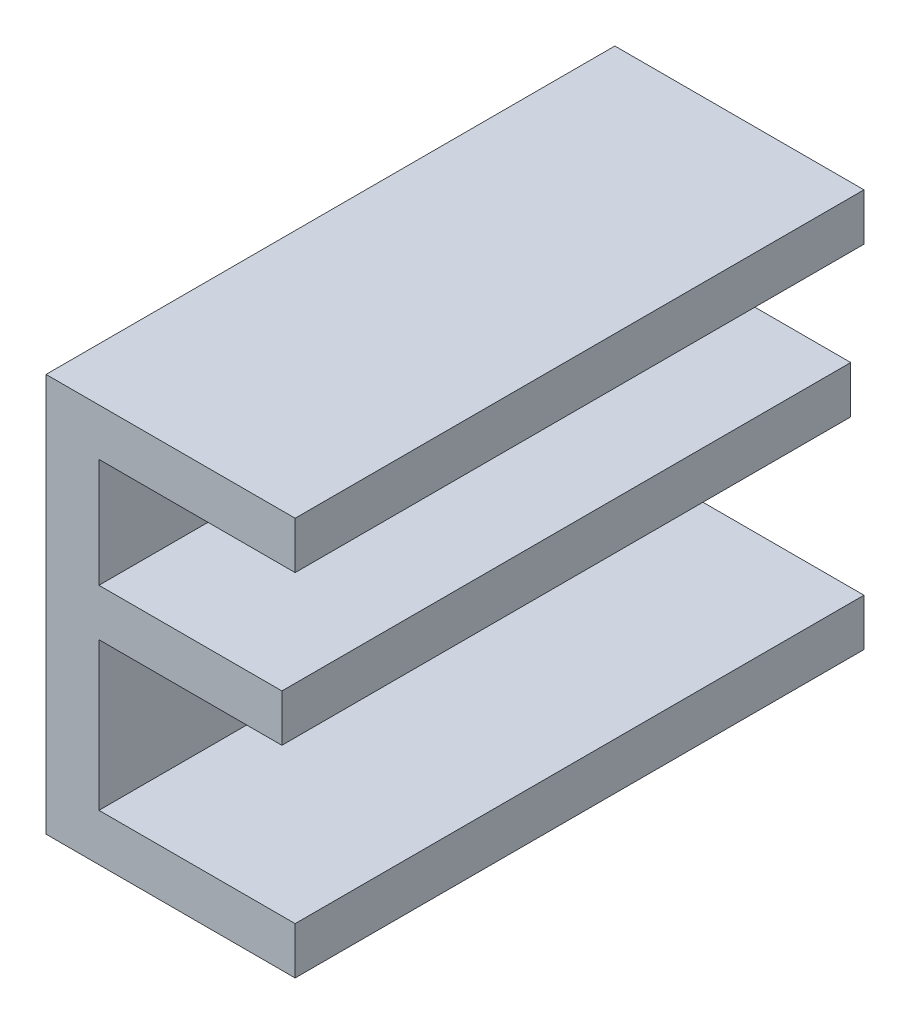
ISO-10303-21;
HEADER;
FILE_DESCRIPTION(('STEP AP214'),'2;1');
FILE_NAME('part.step','',(''),(''),'','','');
FILE_SCHEMA(('AUTOMOTIVE_DESIGN { 1 0 10303 214 1 1 1 1 }'));
ENDSEC;
DATA;
#1=APPLICATION_CONTEXT('core data for automotive mechanical design processes');
#2=APPLICATION_PROTOCOL_DEFINITION('international standard','automotive_design',2000,#1);
#3=PRODUCT_CONTEXT('',#1,'mechanical');
#4=PRODUCT('Part','Part','',(#3));
#5=PRODUCT_RELATED_PRODUCT_CATEGORY('part','',(#4));
#6=PRODUCT_DEFINITION_FORMATION('','',#4);
#7=PRODUCT_DEFINITION_CONTEXT('part definition',#1,'design');
#8=PRODUCT_DEFINITION('design','',#6,#7);
#9=PRODUCT_DEFINITION_SHAPE('','',#8);
#10=(LENGTH_UNIT() NAMED_UNIT(*) SI_UNIT(.MILLI.,.METRE.));
#11=(NAMED_UNIT(*) PLANE_ANGLE_UNIT() SI_UNIT($,.RADIAN.));
#12=(NAMED_UNIT(*) SI_UNIT($,.STERADIAN.) SOLID_ANGLE_UNIT());
#13=UNCERTAINTY_MEASURE_WITH_UNIT(LENGTH_MEASURE(1.E-05),#10,'distance_accuracy_value','');
#14=(GEOMETRIC_REPRESENTATION_CONTEXT(3) GLOBAL_UNCERTAINTY_ASSIGNED_CONTEXT((#13)) GLOBAL_UNIT_ASSIGNED_CONTEXT((#10,
#11,#12)) REPRESENTATION_CONTEXT('',''));
#15=CARTESIAN_POINT('',(0.,0.,0.));
#16=DIRECTION('',(0.,0.,1.));
#17=DIRECTION('',(1.,0.,0.));
#18=AXIS2_PLACEMENT_3D('',#15,#16,#17);
#19=CARTESIAN_POINT('',(0.385190956289428,-0.50191459549901,0.));
#20=DIRECTION('',(0.,1.,0.));
#21=DIRECTION('',(-1.,0.,0.));
#22=AXIS2_PLACEMENT_3D('',#19,#20,#21);
#23=PLANE('',#22);
#24=DIRECTION('',(1.,0.,0.));
#25=VECTOR('',#24,1.);
#26=CARTESIAN_POINT('',(0.341398410367195,-0.50191459549901,0.));
#27=LINE('',#26,#25);
#28=CARTESIAN_POINT('',(0.341398410367195,-0.50191459549901,0.));
#29=VERTEX_POINT('',#28);
#30=CARTESIAN_POINT('',(0.385190956289428,-0.50191459549901,0.));
#31=VERTEX_POINT('',#30);
#32=EDGE_CURVE('E11',#29,#31,#27,.T.);
#33=ORIENTED_EDGE('',*,*,#32,.F.);
#34=DIRECTION('',(0.,0.,1.));
#35=VECTOR('',#34,1.);
#36=CARTESIAN_POINT('',(0.341398410367195,-0.50191459549901,0.));
#37=LINE('',#36,#35);
#38=CARTESIAN_POINT('',(0.341398410367195,-0.50191459549901,0.1));
#39=VERTEX_POINT('',#38);
#40=EDGE_CURVE('E201',#29,#39,#37,.T.);
#41=ORIENTED_EDGE('',*,*,#40,.T.);
#42=DIRECTION('',(-1.,0.,0.));
#43=VECTOR('',#42,1.);
#44=CARTESIAN_POINT('',(0.385190956289428,-0.50191459549901,0.1));
#45=LINE('',#44,#43);
#46=CARTESIAN_POINT('',(0.385190956289428,-0.50191459549901,0.1));
#47=VERTEX_POINT('',#46);
#48=EDGE_CURVE('E127',#47,#39,#45,.T.);
#49=ORIENTED_EDGE('',*,*,#48,.F.);
#50=DIRECTION('',(0.,0.,1.));
#51=VECTOR('',#50,1.);
#52=CARTESIAN_POINT('',(0.385190956289428,-0.50191459549901,0.));
#53=LINE('',#52,#51);
#54=EDGE_CURVE('E196',#31,#47,#53,.T.);
#55=ORIENTED_EDGE('',*,*,#54,.F.);
#56=EDGE_LOOP('',(#33,#41,#49,#55));
#57=FACE_BOUND('',#56,.T.);
#58=ADVANCED_FACE('F17',(#57),#23,.T.);
#59=CARTESIAN_POINT('',(0.385190956289428,-0.510196605479122,0.));
#60=DIRECTION('',(1.,0.,0.));
#61=DIRECTION('',(0.,1.,0.));
#62=AXIS2_PLACEMENT_3D('',#59,#60,#61);
#63=PLANE('',#62);
#64=DIRECTION('',(0.,-1.,0.));
#65=VECTOR('',#64,1.);
#66=CARTESIAN_POINT('',(0.385190956289428,-0.50191459549901,0.));
#67=LINE('',#66,#65);
#68=CARTESIAN_POINT('',(0.385190956289428,-0.510196605479122,0.));
#69=VERTEX_POINT('',#68);
#70=EDGE_CURVE('E24',#31,#69,#67,.T.);
#71=ORIENTED_EDGE('',*,*,#70,.F.);
#72=ORIENTED_EDGE('',*,*,#54,.T.);
#73=DIRECTION('',(0.,1.,0.));
#74=VECTOR('',#73,1.);
#75=CARTESIAN_POINT('',(0.385190956289428,-0.510196605479122,0.1));
#76=LINE('',#75,#74);
#77=CARTESIAN_POINT('',(0.385190956289428,-0.510196605479122,0.1));
#78=VERTEX_POINT('',#77);
#79=EDGE_CURVE('E188',#78,#47,#76,.T.);
#80=ORIENTED_EDGE('',*,*,#79,.F.);
#81=DIRECTION('',(0.,0.,1.));
#82=VECTOR('',#81,1.);
#83=CARTESIAN_POINT('',(0.385190956289428,-0.510196605479122,0.));
#84=LINE('',#83,#82);
#85=EDGE_CURVE('E190',#69,#78,#84,.T.);
#86=ORIENTED_EDGE('',*,*,#85,.F.);
#87=EDGE_LOOP('',(#71,#72,#80,#86));
#88=FACE_BOUND('',#87,.T.);
#89=ADVANCED_FACE('F206',(#88),#63,.T.);
#90=CARTESIAN_POINT('',(0.350701490070882,-0.510196605479122,0.));
#91=DIRECTION('',(0.,-1.,0.));
#92=DIRECTION('',(1.,0.,0.));
#93=AXIS2_PLACEMENT_3D('',#90,#91,#92);
#94=PLANE('',#93);
#95=DIRECTION('',(-1.,0.,0.));
#96=VECTOR('',#95,1.);
#97=CARTESIAN_POINT('',(0.385190956289428,-0.510196605479122,0.));
#98=LINE('',#97,#96);
#99=CARTESIAN_POINT('',(0.350701490070882,-0.510196605479122,0.));
#100=VERTEX_POINT('',#99);
#101=EDGE_CURVE('E198',#69,#100,#98,.T.);
#102=ORIENTED_EDGE('',*,*,#101,.F.);
#103=ORIENTED_EDGE('',*,*,#85,.T.);
#104=DIRECTION('',(1.,0.,0.));
#105=VECTOR('',#104,1.);
#106=CARTESIAN_POINT('',(0.350701490070882,-0.510196605479122,0.1));
#107=LINE('',#106,#105);
#108=CARTESIAN_POINT('',(0.350701490070882,-0.510196605479122,0.1));
#109=VERTEX_POINT('',#108);
#110=EDGE_CURVE('E180',#109,#78,#107,.T.);
#111=ORIENTED_EDGE('',*,*,#110,.F.);
#112=DIRECTION('',(0.,0.,1.));
#113=VECTOR('',#112,1.);
#114=CARTESIAN_POINT('',(0.350701490070882,-0.510196605479122,0.));
#115=LINE('',#114,#113);
#116=EDGE_CURVE('E183',#100,#109,#115,.T.);
#117=ORIENTED_EDGE('',*,*,#116,.F.);
#118=EDGE_LOOP('',(#102,#103,#111,#117));
#119=FACE_BOUND('',#118,.T.);
#120=ADVANCED_FACE('F208',(#119),#94,.T.);
#121=CARTESIAN_POINT('',(0.350701490070882,-0.529370025844037,0.));
#122=DIRECTION('',(1.,0.,0.));
#123=DIRECTION('',(0.,1.,0.));
#124=AXIS2_PLACEMENT_3D('',#121,#122,#123);
#125=PLANE('',#124);
#126=DIRECTION('',(0.,-1.,0.));
#127=VECTOR('',#126,1.);
#128=CARTESIAN_POINT('',(0.350701490070882,-0.510196605479122,0.));
#129=LINE('',#128,#127);
#130=CARTESIAN_POINT('',(0.350701490070882,-0.529370025844037,0.));
#131=VERTEX_POINT('',#130);
#132=EDGE_CURVE('E192',#100,#131,#129,.T.);
#133=ORIENTED_EDGE('',*,*,#132,.F.);
#134=ORIENTED_EDGE('',*,*,#116,.T.);
#135=DIRECTION('',(0.,1.,0.));
#136=VECTOR('',#135,1.);
#137=CARTESIAN_POINT('',(0.350701490070882,-0.529370025844037,0.1));
#138=LINE('',#137,#136);
#139=CARTESIAN_POINT('',(0.350701490070882,-0.529370025844037,0.1));
#140=VERTEX_POINT('',#139);
#141=EDGE_CURVE('E172',#140,#109,#138,.T.);
#142=ORIENTED_EDGE('',*,*,#141,.F.);
#143=DIRECTION('',(0.,0.,1.));
#144=VECTOR('',#143,1.);
#145=CARTESIAN_POINT('',(0.350701490070882,-0.529370025844037,0.));
#146=LINE('',#145,#144);
#147=EDGE_CURVE('E175',#131,#140,#146,.T.);
#148=ORIENTED_EDGE('',*,*,#147,.F.);
#149=EDGE_LOOP('',(#133,#134,#142,#148));
#150=FACE_BOUND('',#149,.T.);
#151=ADVANCED_FACE('F212',(#150),#125,.T.);
#152=CARTESIAN_POINT('',(0.382865186363506,-0.529370025844037,0.));
#153=DIRECTION('',(0.,1.,0.));
#154=DIRECTION('',(-1.,0.,0.));
#155=AXIS2_PLACEMENT_3D('',#152,#153,#154);
#156=PLANE('',#155);
#157=DIRECTION('',(1.,0.,0.));
#158=VECTOR('',#157,1.);
#159=CARTESIAN_POINT('',(0.350701490070882,-0.529370025844037,0.));
#160=LINE('',#159,#158);
#161=CARTESIAN_POINT('',(0.382865186363506,-0.529370025844037,0.));
#162=VERTEX_POINT('',#161);
#163=EDGE_CURVE('E185',#131,#162,#160,.T.);
#164=ORIENTED_EDGE('',*,*,#163,.F.);
#165=ORIENTED_EDGE('',*,*,#147,.T.);
#166=DIRECTION('',(-1.,0.,0.));
#167=VECTOR('',#166,1.);
#168=CARTESIAN_POINT('',(0.382865186363506,-0.529370025844037,0.1));
#169=LINE('',#168,#167);
#170=CARTESIAN_POINT('',(0.382865186363506,-0.529370025844037,0.1));
#171=VERTEX_POINT('',#170);
#172=EDGE_CURVE('E164',#171,#140,#169,.T.);
#173=ORIENTED_EDGE('',*,*,#172,.F.);
#174=DIRECTION('',(0.,0.,1.));
#175=VECTOR('',#174,1.);
#176=CARTESIAN_POINT('',(0.382865186363506,-0.529370025844037,0.));
#177=LINE('',#176,#175);
#178=EDGE_CURVE('E167',#162,#171,#177,.T.);
#179=ORIENTED_EDGE('',*,*,#178,.F.);
#180=EDGE_LOOP('',(#164,#165,#173,#179));
#181=FACE_BOUND('',#180,.T.);
#182=ADVANCED_FACE('F216',(#181),#156,.T.);
#183=CARTESIAN_POINT('',(0.382865186363506,-0.537652035824149,0.));
#184=DIRECTION('',(1.,0.,0.));
#185=DIRECTION('',(0.,1.,0.));
#186=AXIS2_PLACEMENT_3D('',#183,#184,#185);
#187=PLANE('',#186);
#188=DIRECTION('',(0.,-1.,0.));
#189=VECTOR('',#188,1.);
#190=CARTESIAN_POINT('',(0.382865186363506,-0.529370025844037,0.));
#191=LINE('',#190,#189);
#192=CARTESIAN_POINT('',(0.382865186363506,-0.537652035824149,0.));
#193=VERTEX_POINT('',#192);
#194=EDGE_CURVE('E177',#162,#193,#191,.T.);
#195=ORIENTED_EDGE('',*,*,#194,.F.);
#196=ORIENTED_EDGE('',*,*,#178,.T.);
#197=DIRECTION('',(0.,1.,0.));
#198=VECTOR('',#197,1.);
#199=CARTESIAN_POINT('',(0.382865186363506,-0.537652035824149,0.1));
#200=LINE('',#199,#198);
#201=CARTESIAN_POINT('',(0.382865186363506,-0.537652035824149,0.1));
#202=VERTEX_POINT('',#201);
#203=EDGE_CURVE('E156',#202,#171,#200,.T.);
#204=ORIENTED_EDGE('',*,*,#203,.F.);
#205=DIRECTION('',(0.,0.,1.));
#206=VECTOR('',#205,1.);
#207=CARTESIAN_POINT('',(0.382865186363506,-0.537652035824149,0.));
#208=LINE('',#207,#206);
#209=EDGE_CURVE('E159',#193,#202,#208,.T.);
#210=ORIENTED_EDGE('',*,*,#209,.F.);
#211=EDGE_LOOP('',(#195,#196,#204,#210));
#212=FACE_BOUND('',#211,.T.);
#213=ADVANCED_FACE('F220',(#212),#187,.T.);
#214=CARTESIAN_POINT('',(0.350701490070882,-0.537652035824149,0.));
#215=DIRECTION('',(0.,-1.,0.));
#216=DIRECTION('',(1.,0.,0.));
#217=AXIS2_PLACEMENT_3D('',#214,#215,#216);
#218=PLANE('',#217);
#219=DIRECTION('',(-1.,0.,0.));
#220=VECTOR('',#219,1.);
#221=CARTESIAN_POINT('',(0.382865186363506,-0.537652035824149,0.));
#222=LINE('',#221,#220);
#223=CARTESIAN_POINT('',(0.350701490070882,-0.537652035824149,0.));
#224=VERTEX_POINT('',#223);
#225=EDGE_CURVE('E169',#193,#224,#222,.T.);
#226=ORIENTED_EDGE('',*,*,#225,.F.);
#227=ORIENTED_EDGE('',*,*,#209,.T.);
#228=DIRECTION('',(1.,0.,0.));
#229=VECTOR('',#228,1.);
#230=CARTESIAN_POINT('',(0.350701490070882,-0.537652035824149,0.1));
#231=LINE('',#230,#229);
#232=CARTESIAN_POINT('',(0.350701490070882,-0.537652035824149,0.1));
#233=VERTEX_POINT('',#232);
#234=EDGE_CURVE('E148',#233,#202,#231,.T.);
#235=ORIENTED_EDGE('',*,*,#234,.F.);
#236=DIRECTION('',(0.,0.,1.));
#237=VECTOR('',#236,1.);
#238=CARTESIAN_POINT('',(0.350701490070882,-0.537652035824149,0.));
#239=LINE('',#238,#237);
#240=EDGE_CURVE('E151',#224,#233,#239,.T.);
#241=ORIENTED_EDGE('',*,*,#240,.F.);
#242=EDGE_LOOP('',(#226,#227,#235,#241));
#243=FACE_BOUND('',#242,.T.);
#244=ADVANCED_FACE('F224',(#243),#218,.T.);
#245=CARTESIAN_POINT('',(0.350701490070882,-0.563632587679567,0.));
#246=DIRECTION('',(1.,0.,0.));
#247=DIRECTION('',(0.,1.,0.));
#248=AXIS2_PLACEMENT_3D('',#245,#246,#247);
#249=PLANE('',#248);
#250=DIRECTION('',(0.,-1.,0.));
#251=VECTOR('',#250,1.);
#252=CARTESIAN_POINT('',(0.350701490070882,-0.537652035824149,0.));
#253=LINE('',#252,#251);
#254=CARTESIAN_POINT('',(0.350701490070882,-0.563632587679567,0.));
#255=VERTEX_POINT('',#254);
#256=EDGE_CURVE('E161',#224,#255,#253,.T.);
#257=ORIENTED_EDGE('',*,*,#256,.F.);
#258=ORIENTED_EDGE('',*,*,#240,.T.);
#259=DIRECTION('',(0.,1.,0.));
#260=VECTOR('',#259,1.);
#261=CARTESIAN_POINT('',(0.350701490070882,-0.563632587679567,0.1));
#262=LINE('',#261,#260);
#263=CARTESIAN_POINT('',(0.350701490070882,-0.563632587679567,0.1));
#264=VERTEX_POINT('',#263);
#265=EDGE_CURVE('E140',#264,#233,#262,.T.);
#266=ORIENTED_EDGE('',*,*,#265,.F.);
#267=DIRECTION('',(0.,0.,1.));
#268=VECTOR('',#267,1.);
#269=CARTESIAN_POINT('',(0.350701490070882,-0.563632587679567,0.));
#270=LINE('',#269,#268);
#271=EDGE_CURVE('E143',#255,#264,#270,.T.);
#272=ORIENTED_EDGE('',*,*,#271,.F.);
#273=EDGE_LOOP('',(#257,#258,#266,#272));
#274=FACE_BOUND('',#273,.T.);
#275=ADVANCED_FACE('F228',(#274),#249,.T.);
#276=CARTESIAN_POINT('',(0.385190956289428,-0.563632587679567,0.));
#277=DIRECTION('',(0.,1.,0.));
#278=DIRECTION('',(-1.,0.,0.));
#279=AXIS2_PLACEMENT_3D('',#276,#277,#278);
#280=PLANE('',#279);
#281=DIRECTION('',(1.,0.,0.));
#282=VECTOR('',#281,1.);
#283=CARTESIAN_POINT('',(0.350701490070882,-0.563632587679567,0.));
#284=LINE('',#283,#282);
#285=CARTESIAN_POINT('',(0.385190956289428,-0.563632587679567,0.));
#286=VERTEX_POINT('',#285);
#287=EDGE_CURVE('E153',#255,#286,#284,.T.);
#288=ORIENTED_EDGE('',*,*,#287,.F.);
#289=ORIENTED_EDGE('',*,*,#271,.T.);
#290=DIRECTION('',(-1.,0.,0.));
#291=VECTOR('',#290,1.);
#292=CARTESIAN_POINT('',(0.385190956289428,-0.563632587679567,0.1));
#293=LINE('',#292,#291);
#294=CARTESIAN_POINT('',(0.385190956289428,-0.563632587679567,0.1));
#295=VERTEX_POINT('',#294);
#296=EDGE_CURVE('E133',#295,#264,#293,.T.);
#297=ORIENTED_EDGE('',*,*,#296,.F.);
#298=DIRECTION('',(0.,0.,1.));
#299=VECTOR('',#298,1.);
#300=CARTESIAN_POINT('',(0.385190956289428,-0.563632587679567,0.));
#301=LINE('',#300,#299);
#302=EDGE_CURVE('E136',#286,#295,#301,.T.);
#303=ORIENTED_EDGE('',*,*,#302,.F.);
#304=EDGE_LOOP('',(#288,#289,#297,#303));
#305=FACE_BOUND('',#304,.T.);
#306=ADVANCED_FACE('F232',(#305),#280,.T.);
#307=CARTESIAN_POINT('',(0.385190956289428,-0.571914597659679,0.));
#308=DIRECTION('',(1.,0.,0.));
#309=DIRECTION('',(0.,1.,0.));
#310=AXIS2_PLACEMENT_3D('',#307,#308,#309);
#311=PLANE('',#310);
#312=DIRECTION('',(0.,-1.,0.));
#313=VECTOR('',#312,1.);
#314=CARTESIAN_POINT('',(0.385190956289428,-0.563632587679567,0.));
#315=LINE('',#314,#313);
#316=CARTESIAN_POINT('',(0.385190956289428,-0.571914597659679,0.));
#317=VERTEX_POINT('',#316);
#318=EDGE_CURVE('E145',#286,#317,#315,.T.);
#319=ORIENTED_EDGE('',*,*,#318,.F.);
#320=ORIENTED_EDGE('',*,*,#302,.T.);
#321=DIRECTION('',(0.,1.,0.));
#322=VECTOR('',#321,1.);
#323=CARTESIAN_POINT('',(0.385190956289428,-0.571914597659679,0.1));
#324=LINE('',#323,#322);
#325=CARTESIAN_POINT('',(0.385190956289428,-0.571914597659679,0.1));
#326=VERTEX_POINT('',#325);
#327=EDGE_CURVE('E113',#326,#295,#324,.T.);
#328=ORIENTED_EDGE('',*,*,#327,.F.);
#329=DIRECTION('',(0.,0.,1.));
#330=VECTOR('',#329,1.);
#331=CARTESIAN_POINT('',(0.385190956289428,-0.571914597659679,0.));
#332=LINE('',#331,#330);
#333=EDGE_CURVE('E119',#317,#326,#332,.T.);
#334=ORIENTED_EDGE('',*,*,#333,.F.);
#335=EDGE_LOOP('',(#319,#320,#328,#334));
#336=FACE_BOUND('',#335,.T.);
#337=ADVANCED_FACE('F235',(#336),#311,.T.);
#338=CARTESIAN_POINT('',(0.341398410367195,-0.571914597659679,0.));
#339=DIRECTION('',(0.,-1.,0.));
#340=DIRECTION('',(1.,0.,0.));
#341=AXIS2_PLACEMENT_3D('',#338,#339,#340);
#342=PLANE('',#341);
#343=DIRECTION('',(-1.,0.,0.));
#344=VECTOR('',#343,1.);
#345=CARTESIAN_POINT('',(0.385190956289428,-0.571914597659679,0.));
#346=LINE('',#345,#344);
#347=CARTESIAN_POINT('',(0.341398410367195,-0.571914597659679,0.));
#348=VERTEX_POINT('',#347);
#349=EDGE_CURVE('E138',#317,#348,#346,.T.);
#350=ORIENTED_EDGE('',*,*,#349,.F.);
#351=ORIENTED_EDGE('',*,*,#333,.T.);
#352=DIRECTION('',(1.,0.,0.));
#353=VECTOR('',#352,1.);
#354=CARTESIAN_POINT('',(0.341398410367195,-0.571914597659679,0.1));
#355=LINE('',#354,#353);
#356=CARTESIAN_POINT('',(0.341398410367195,-0.571914597659679,0.1));
#357=VERTEX_POINT('',#356);
#358=EDGE_CURVE('E114',#357,#326,#355,.T.);
#359=ORIENTED_EDGE('',*,*,#358,.F.);
#360=DIRECTION('',(0.,0.,1.));
#361=VECTOR('',#360,1.);
#362=CARTESIAN_POINT('',(0.341398410367195,-0.571914597659679,0.));
#363=LINE('',#362,#361);
#364=EDGE_CURVE('E103',#348,#357,#363,.T.);
#365=ORIENTED_EDGE('',*,*,#364,.F.);
#366=EDGE_LOOP('',(#350,#351,#359,#365));
#367=FACE_BOUND('',#366,.T.);
#368=ADVANCED_FACE('F117',(#367),#342,.T.);
#369=CARTESIAN_POINT('',(0.341398410367195,-0.50191459549901,0.));
#370=DIRECTION('',(-1.,0.,0.));
#371=DIRECTION('',(0.,-1.,0.));
#372=AXIS2_PLACEMENT_3D('',#369,#370,#371);
#373=PLANE('',#372);
#374=DIRECTION('',(0.,1.,0.));
#375=VECTOR('',#374,1.);
#376=CARTESIAN_POINT('',(0.341398410367195,-0.571914597659679,0.));
#377=LINE('',#376,#375);
#378=EDGE_CURVE('E110',#348,#29,#377,.T.);
#379=ORIENTED_EDGE('',*,*,#378,.F.);
#380=ORIENTED_EDGE('',*,*,#364,.T.);
#381=DIRECTION('',(0.,-1.,0.));
#382=VECTOR('',#381,1.);
#383=CARTESIAN_POINT('',(0.341398410367195,-0.50191459549901,0.1));
#384=LINE('',#383,#382);
#385=EDGE_CURVE('E108',#39,#357,#384,.T.);
#386=ORIENTED_EDGE('',*,*,#385,.F.);
#387=ORIENTED_EDGE('',*,*,#40,.F.);
#388=EDGE_LOOP('',(#379,#380,#386,#387));
#389=FACE_BOUND('',#388,.T.);
#390=ADVANCED_FACE('F105',(#389),#373,.T.);
#391=CARTESIAN_POINT('',(0.360436970279693,-0.536307925162319,0.));
#392=DIRECTION('',(0.,0.,1.));
#393=DIRECTION('',(1.,0.,0.));
#394=AXIS2_PLACEMENT_3D('',#391,#392,#393);
#395=PLANE('',#394);
#396=ORIENTED_EDGE('',*,*,#378,.T.);
#397=ORIENTED_EDGE('',*,*,#32,.T.);
#398=ORIENTED_EDGE('',*,*,#70,.T.);
#399=ORIENTED_EDGE('',*,*,#101,.T.);
#400=ORIENTED_EDGE('',*,*,#132,.T.);
#401=ORIENTED_EDGE('',*,*,#163,.T.);
#402=ORIENTED_EDGE('',*,*,#194,.T.);
#403=ORIENTED_EDGE('',*,*,#225,.T.);
#404=ORIENTED_EDGE('',*,*,#256,.T.);
#405=ORIENTED_EDGE('',*,*,#287,.T.);
#406=ORIENTED_EDGE('',*,*,#318,.T.);
#407=ORIENTED_EDGE('',*,*,#349,.T.);
#408=EDGE_LOOP('',(#396,#397,#398,#399,#400,#401,#402,#403,#404,#405,#406,#407));
#409=FACE_BOUND('',#408,.T.);
#410=ADVANCED_FACE('F203',(#409),#395,.F.);
#411=CARTESIAN_POINT('',(0.360436970279693,-0.536307925162319,0.1));
#412=DIRECTION('',(0.,0.,1.));
#413=DIRECTION('',(1.,0.,0.));
#414=AXIS2_PLACEMENT_3D('',#411,#412,#413);
#415=PLANE('',#414);
#416=ORIENTED_EDGE('',*,*,#385,.T.);
#417=ORIENTED_EDGE('',*,*,#358,.T.);
#418=ORIENTED_EDGE('',*,*,#327,.T.);
#419=ORIENTED_EDGE('',*,*,#296,.T.);
#420=ORIENTED_EDGE('',*,*,#265,.T.);
#421=ORIENTED_EDGE('',*,*,#234,.T.);
#422=ORIENTED_EDGE('',*,*,#203,.T.);
#423=ORIENTED_EDGE('',*,*,#172,.T.);
#424=ORIENTED_EDGE('',*,*,#141,.T.);
#425=ORIENTED_EDGE('',*,*,#110,.T.);
#426=ORIENTED_EDGE('',*,*,#79,.T.);
#427=ORIENTED_EDGE('',*,*,#48,.T.);
#428=EDGE_LOOP('',(#416,#417,#418,#419,#420,#421,#422,#423,#424,#425,#426,#427));
#429=FACE_BOUND('',#428,.T.);
#430=ADVANCED_FACE('F124',(#429),#415,.T.);
#431=CLOSED_SHELL('',(#58,#89,#120,#151,#182,#213,#244,#275,#306,#337,#368,#390,#410,#430));
#432=MANIFOLD_SOLID_BREP('B1',#431);
#433=ADVANCED_BREP_SHAPE_REPRESENTATION('',(#18,#432),#14);
#434=SHAPE_DEFINITION_REPRESENTATION(#9,#433);
ENDSEC;
END-ISO-10303-21;
